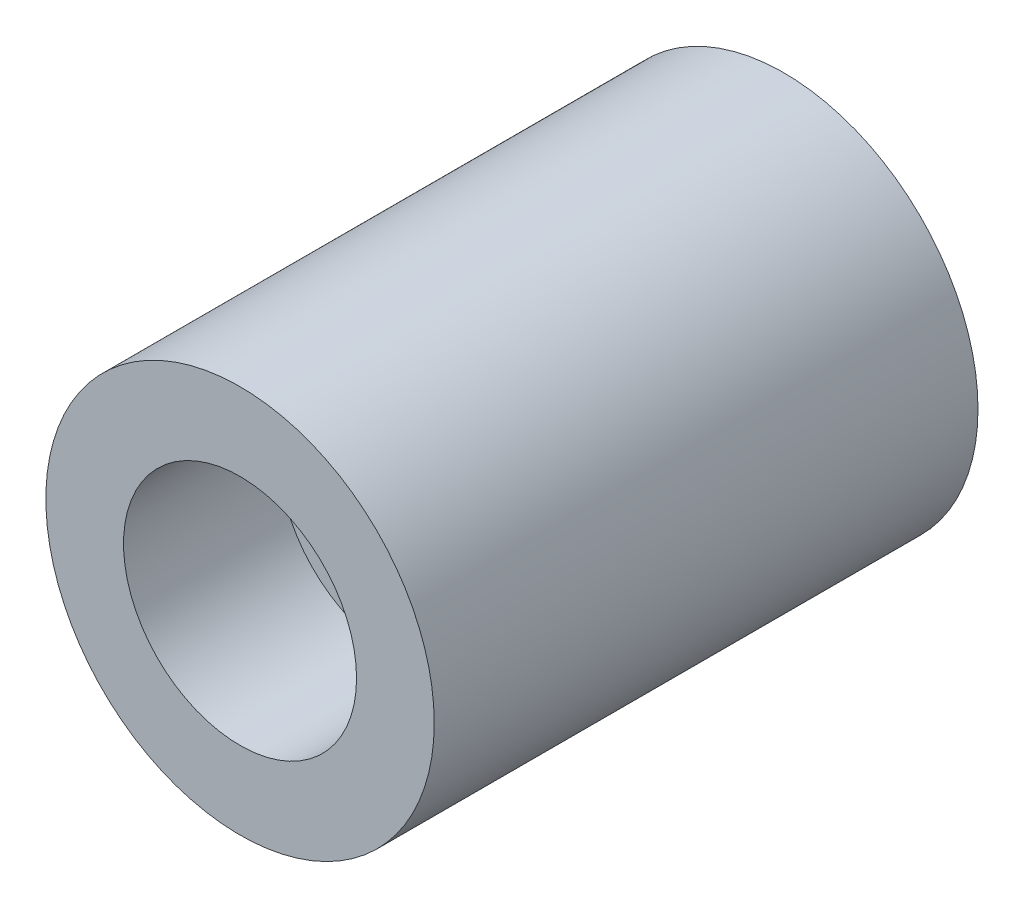
ISO-10303-21;
HEADER;
FILE_DESCRIPTION(('STEP AP214'),'2;1');
FILE_NAME('part.step','',(''),(''),'','','');
FILE_SCHEMA(('AUTOMOTIVE_DESIGN { 1 0 10303 214 1 1 1 1 }'));
ENDSEC;
DATA;
#1=APPLICATION_CONTEXT('core data for automotive mechanical design processes');
#2=APPLICATION_PROTOCOL_DEFINITION('international standard','automotive_design',2000,#1);
#3=PRODUCT_CONTEXT('',#1,'mechanical');
#4=PRODUCT('Part','Part','',(#3));
#5=PRODUCT_RELATED_PRODUCT_CATEGORY('part','',(#4));
#6=PRODUCT_DEFINITION_FORMATION('','',#4);
#7=PRODUCT_DEFINITION_CONTEXT('part definition',#1,'design');
#8=PRODUCT_DEFINITION('design','',#6,#7);
#9=PRODUCT_DEFINITION_SHAPE('','',#8);
#10=(LENGTH_UNIT() NAMED_UNIT(*) SI_UNIT(.MILLI.,.METRE.));
#11=(NAMED_UNIT(*) PLANE_ANGLE_UNIT() SI_UNIT($,.RADIAN.));
#12=(NAMED_UNIT(*) SI_UNIT($,.STERADIAN.) SOLID_ANGLE_UNIT());
#13=UNCERTAINTY_MEASURE_WITH_UNIT(LENGTH_MEASURE(1.E-05),#10,'distance_accuracy_value','');
#14=(GEOMETRIC_REPRESENTATION_CONTEXT(3) GLOBAL_UNCERTAINTY_ASSIGNED_CONTEXT((#13)) GLOBAL_UNIT_ASSIGNED_CONTEXT((#10,
#11,#12)) REPRESENTATION_CONTEXT('',''));
#15=CARTESIAN_POINT('',(0.,0.,0.));
#16=DIRECTION('',(0.,0.,1.));
#17=DIRECTION('',(1.,0.,0.));
#18=AXIS2_PLACEMENT_3D('',#15,#16,#17);
#19=CARTESIAN_POINT('',(0.,0.,-3556.));
#20=DIRECTION('',(0.,0.,-1.));
#21=DIRECTION('',(-1.,0.,0.));
#22=AXIS2_PLACEMENT_3D('',#19,#20,#21);
#23=PLANE('',#22);
#24=CARTESIAN_POINT('',(0.,0.,-3556.));
#25=DIRECTION('',(0.,0.,1.));
#26=DIRECTION('',(1.,0.,0.));
#27=AXIS2_PLACEMENT_3D('',#24,#25,#26);
#28=CIRCLE('',#27,1270.);
#29=CARTESIAN_POINT('',(1270.,0.,-3556.));
#30=VERTEX_POINT('',#29);
#31=EDGE_CURVE('E10',#30,#30,#28,.T.);
#32=ORIENTED_EDGE('',*,*,#31,.F.);
#33=EDGE_LOOP('',(#32));
#34=FACE_BOUND('',#33,.T.);
#35=ADVANCED_FACE('F31',(#34),#23,.T.);
#36=CARTESIAN_POINT('',(0.,0.,0.));
#37=DIRECTION('',(0.,0.,1.));
#38=DIRECTION('',(1.,0.,0.));
#39=AXIS2_PLACEMENT_3D('',#36,#37,#38);
#40=CYLINDRICAL_SURFACE('',#39,1270.);
#41=ORIENTED_EDGE('',*,*,#31,.T.);
#42=EDGE_LOOP('',(#41));
#43=FACE_BOUND('',#42,.T.);
#44=CARTESIAN_POINT('',(0.,0.,-1.22119891973923E-13));
#45=DIRECTION('',(0.,0.,1.));
#46=DIRECTION('',(1.,0.,0.));
#47=AXIS2_PLACEMENT_3D('',#44,#45,#46);
#48=CIRCLE('',#47,1270.);
#49=CARTESIAN_POINT('',(1270.,0.,-1.22119891973923E-13));
#50=VERTEX_POINT('',#49);
#51=EDGE_CURVE('E37',#50,#50,#48,.T.);
#52=ORIENTED_EDGE('',*,*,#51,.F.);
#53=EDGE_LOOP('',(#52));
#54=FACE_BOUND('',#53,.T.);
#55=ADVANCED_FACE('F73',(#43,#54),#40,.T.);
#56=CARTESIAN_POINT('',(1270.,0.,0.));
#57=DIRECTION('',(0.,0.,1.));
#58=DIRECTION('',(1.,0.,0.));
#59=AXIS2_PLACEMENT_3D('',#56,#57,#58);
#60=PLANE('',#59);
#61=ORIENTED_EDGE('',*,*,#51,.T.);
#62=EDGE_LOOP('',(#61));
#63=FACE_BOUND('',#62,.T.);
#64=CARTESIAN_POINT('',(0.,0.,0.));
#65=DIRECTION('',(0.,0.,1.));
#66=DIRECTION('',(1.,0.,0.));
#67=AXIS2_PLACEMENT_3D('',#64,#65,#66);
#68=CIRCLE('',#67,762.);
#69=CARTESIAN_POINT('',(762.,0.,0.));
#70=VERTEX_POINT('',#69);
#71=EDGE_CURVE('E41',#70,#70,#68,.T.);
#72=ORIENTED_EDGE('',*,*,#71,.F.);
#73=EDGE_LOOP('',(#72));
#74=FACE_BOUND('',#73,.T.);
#75=ADVANCED_FACE('F78',(#63,#74),#60,.T.);
#76=CARTESIAN_POINT('',(0.,0.,0.));
#77=DIRECTION('',(0.,0.,1.));
#78=DIRECTION('',(1.,0.,0.));
#79=AXIS2_PLACEMENT_3D('',#76,#77,#78);
#80=CYLINDRICAL_SURFACE('',#79,762.);
#81=ORIENTED_EDGE('',*,*,#71,.T.);
#82=EDGE_LOOP('',(#81));
#83=FACE_BOUND('',#82,.T.);
#84=CARTESIAN_POINT('',(0.,0.,-1016.));
#85=DIRECTION('',(0.,0.,1.));
#86=DIRECTION('',(1.,0.,0.));
#87=AXIS2_PLACEMENT_3D('',#84,#85,#86);
#88=CIRCLE('',#87,762.);
#89=CARTESIAN_POINT('',(762.,0.,-1016.));
#90=VERTEX_POINT('',#89);
#91=EDGE_CURVE('E45',#90,#90,#88,.T.);
#92=ORIENTED_EDGE('',*,*,#91,.F.);
#93=EDGE_LOOP('',(#92));
#94=FACE_BOUND('',#93,.T.);
#95=ADVANCED_FACE('F69',(#83,#94),#80,.F.);
#96=CARTESIAN_POINT('',(762.,0.,-1016.));
#97=DIRECTION('',(0.,0.,1.));
#98=DIRECTION('',(1.,0.,0.));
#99=AXIS2_PLACEMENT_3D('',#96,#97,#98);
#100=PLANE('',#99);
#101=ORIENTED_EDGE('',*,*,#91,.T.);
#102=EDGE_LOOP('',(#101));
#103=FACE_BOUND('',#102,.T.);
#104=CARTESIAN_POINT('',(0.,0.,-1016.));
#105=DIRECTION('',(0.,0.,1.));
#106=DIRECTION('',(1.,0.,0.));
#107=AXIS2_PLACEMENT_3D('',#104,#105,#106);
#108=CIRCLE('',#107,254.);
#109=CARTESIAN_POINT('',(254.,0.,-1016.));
#110=VERTEX_POINT('',#109);
#111=EDGE_CURVE('E50',#110,#110,#108,.T.);
#112=ORIENTED_EDGE('',*,*,#111,.F.);
#113=EDGE_LOOP('',(#112));
#114=FACE_BOUND('',#113,.T.);
#115=ADVANCED_FACE('F61',(#103,#114),#100,.T.);
#116=CARTESIAN_POINT('',(0.,0.,0.));
#117=DIRECTION('',(0.,0.,1.));
#118=DIRECTION('',(1.,0.,0.));
#119=AXIS2_PLACEMENT_3D('',#116,#117,#118);
#120=CYLINDRICAL_SURFACE('',#119,254.);
#121=ORIENTED_EDGE('',*,*,#111,.T.);
#122=EDGE_LOOP('',(#121));
#123=FACE_BOUND('',#122,.T.);
#124=CARTESIAN_POINT('',(0.,0.,-3048.));
#125=DIRECTION('',(0.,0.,1.));
#126=DIRECTION('',(1.,0.,0.));
#127=AXIS2_PLACEMENT_3D('',#124,#125,#126);
#128=CIRCLE('',#127,254.);
#129=CARTESIAN_POINT('',(254.,0.,-3048.));
#130=VERTEX_POINT('',#129);
#131=EDGE_CURVE('E53',#130,#130,#128,.T.);
#132=ORIENTED_EDGE('',*,*,#131,.F.);
#133=EDGE_LOOP('',(#132));
#134=FACE_BOUND('',#133,.T.);
#135=ADVANCED_FACE('F59',(#123,#134),#120,.F.);
#136=CARTESIAN_POINT('',(254.,0.,-3048.));
#137=DIRECTION('',(0.,0.,1.));
#138=DIRECTION('',(1.,0.,0.));
#139=AXIS2_PLACEMENT_3D('',#136,#137,#138);
#140=PLANE('',#139);
#141=ORIENTED_EDGE('',*,*,#131,.T.);
#142=EDGE_LOOP('',(#141));
#143=FACE_BOUND('',#142,.T.);
#144=ADVANCED_FACE('F57',(#143),#140,.T.);
#145=CLOSED_SHELL('',(#35,#55,#75,#95,#115,#135,#144));
#146=MANIFOLD_SOLID_BREP('B2',#145);
#147=ADVANCED_BREP_SHAPE_REPRESENTATION('',(#18,#146),#14);
#148=SHAPE_DEFINITION_REPRESENTATION(#9,#147);
ENDSEC;
END-ISO-10303-21;
